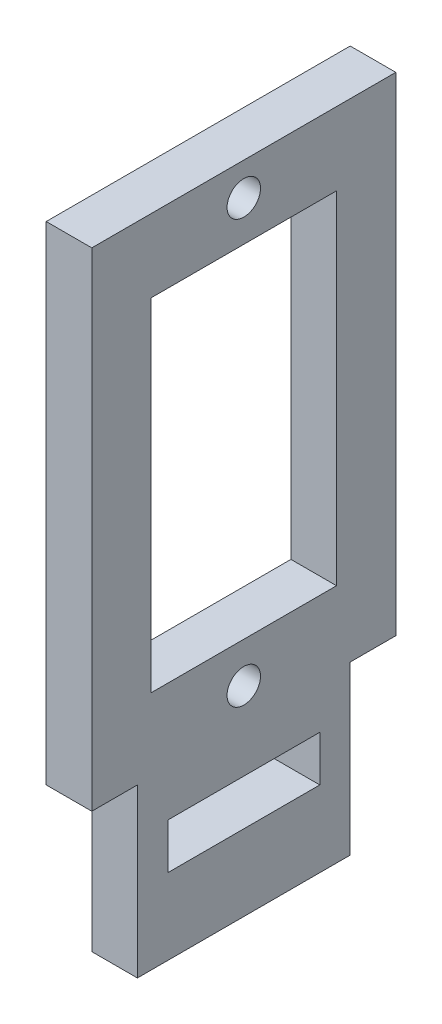
ISO-10303-21;
HEADER;
FILE_DESCRIPTION(('STEP AP214'),'2;1');
FILE_NAME('part.step','',(''),(''),'','','');
FILE_SCHEMA(('AUTOMOTIVE_DESIGN { 1 0 10303 214 1 1 1 1 }'));
ENDSEC;
DATA;
#1=APPLICATION_CONTEXT('core data for automotive mechanical design processes');
#2=APPLICATION_PROTOCOL_DEFINITION('international standard','automotive_design',2000,#1);
#3=PRODUCT_CONTEXT('',#1,'mechanical');
#4=PRODUCT('Part','Part','',(#3));
#5=PRODUCT_RELATED_PRODUCT_CATEGORY('part','',(#4));
#6=PRODUCT_DEFINITION_FORMATION('','',#4);
#7=PRODUCT_DEFINITION_CONTEXT('part definition',#1,'design');
#8=PRODUCT_DEFINITION('design','',#6,#7);
#9=PRODUCT_DEFINITION_SHAPE('','',#8);
#10=(LENGTH_UNIT() NAMED_UNIT(*) SI_UNIT(.MILLI.,.METRE.));
#11=(NAMED_UNIT(*) PLANE_ANGLE_UNIT() SI_UNIT($,.RADIAN.));
#12=(NAMED_UNIT(*) SI_UNIT($,.STERADIAN.) SOLID_ANGLE_UNIT());
#13=UNCERTAINTY_MEASURE_WITH_UNIT(LENGTH_MEASURE(1.E-05),#10,'distance_accuracy_value','');
#14=(GEOMETRIC_REPRESENTATION_CONTEXT(3) GLOBAL_UNCERTAINTY_ASSIGNED_CONTEXT((#13)) GLOBAL_UNIT_ASSIGNED_CONTEXT((#10,
#11,#12)) REPRESENTATION_CONTEXT('',''));
#15=CARTESIAN_POINT('',(0.,0.,0.));
#16=DIRECTION('',(0.,0.,1.));
#17=DIRECTION('',(1.,0.,0.));
#18=AXIS2_PLACEMENT_3D('',#15,#16,#17);
#19=CARTESIAN_POINT('',(3.,0.,0.));
#20=DIRECTION('',(-1.,0.,0.));
#21=DIRECTION('',(0.,0.,1.));
#22=AXIS2_PLACEMENT_3D('',#19,#20,#21);
#23=PLANE('',#22);
#24=CARTESIAN_POINT('',(3.,13.15,-10.));
#25=DIRECTION('',(-1.,0.,0.));
#26=DIRECTION('',(0.,0.,1.));
#27=AXIS2_PLACEMENT_3D('',#24,#25,#26);
#28=CIRCLE('',#27,1.1);
#29=CARTESIAN_POINT('',(3.,13.15,-8.9));
#30=VERTEX_POINT('',#29);
#31=EDGE_CURVE('E229',#30,#30,#28,.T.);
#32=ORIENTED_EDGE('',*,*,#31,.T.);
#33=EDGE_LOOP('',(#32));
#34=FACE_BOUND('',#33,.T.);
#35=DIRECTION('',(0.,0.,1.));
#36=VECTOR('',#35,1.);
#37=CARTESIAN_POINT('',(3.,15.8,-16.1));
#38=LINE('',#37,#36);
#39=CARTESIAN_POINT('',(3.,15.8,-16.1));
#40=VERTEX_POINT('',#39);
#41=CARTESIAN_POINT('',(3.,15.8,-3.9));
#42=VERTEX_POINT('',#41);
#43=EDGE_CURVE('E156',#40,#42,#38,.T.);
#44=ORIENTED_EDGE('',*,*,#43,.T.);
#45=DIRECTION('',(0.,1.,0.));
#46=VECTOR('',#45,1.);
#47=CARTESIAN_POINT('',(3.,15.8,-3.9));
#48=LINE('',#47,#46);
#49=CARTESIAN_POINT('',(3.,38.3,-3.9));
#50=VERTEX_POINT('',#49);
#51=EDGE_CURVE('E150',#42,#50,#48,.T.);
#52=ORIENTED_EDGE('',*,*,#51,.T.);
#53=DIRECTION('',(0.,0.,-1.));
#54=VECTOR('',#53,1.);
#55=CARTESIAN_POINT('',(3.,38.3,-16.1));
#56=LINE('',#55,#54);
#57=CARTESIAN_POINT('',(3.,38.3,-16.1));
#58=VERTEX_POINT('',#57);
#59=EDGE_CURVE('E159',#50,#58,#56,.T.);
#60=ORIENTED_EDGE('',*,*,#59,.T.);
#61=DIRECTION('',(0.,-1.,0.));
#62=VECTOR('',#61,1.);
#63=CARTESIAN_POINT('',(3.,15.8,-16.1));
#64=LINE('',#63,#62);
#65=EDGE_CURVE('E50',#58,#40,#64,.T.);
#66=ORIENTED_EDGE('',*,*,#65,.T.);
#67=EDGE_LOOP('',(#44,#52,#60,#66));
#68=FACE_BOUND('',#67,.T.);
#69=CARTESIAN_POINT('',(3.,40.95,-10.));
#70=DIRECTION('',(-1.,0.,0.));
#71=DIRECTION('',(0.,0.,1.));
#72=AXIS2_PLACEMENT_3D('',#69,#70,#71);
#73=CIRCLE('',#72,1.1);
#74=CARTESIAN_POINT('',(3.,40.95,-8.90000000000001));
#75=VERTEX_POINT('',#74);
#76=EDGE_CURVE('E222',#75,#75,#73,.T.);
#77=ORIENTED_EDGE('',*,*,#76,.T.);
#78=EDGE_LOOP('',(#77));
#79=FACE_BOUND('',#78,.T.);
#80=DIRECTION('',(0.,1.,0.));
#81=VECTOR('',#80,1.);
#82=CARTESIAN_POINT('',(3.,0.,-17.));
#83=LINE('',#82,#81);
#84=CARTESIAN_POINT('',(3.,0.,-17.));
#85=VERTEX_POINT('',#84);
#86=CARTESIAN_POINT('',(3.,11.,-17.));
#87=VERTEX_POINT('',#86);
#88=EDGE_CURVE('E187',#85,#87,#83,.T.);
#89=ORIENTED_EDGE('',*,*,#88,.T.);
#90=DIRECTION('',(0.,0.,-1.));
#91=VECTOR('',#90,1.);
#92=CARTESIAN_POINT('',(3.,11.,-20.));
#93=LINE('',#92,#91);
#94=CARTESIAN_POINT('',(3.,11.,-20.));
#95=VERTEX_POINT('',#94);
#96=EDGE_CURVE('E190',#87,#95,#93,.T.);
#97=ORIENTED_EDGE('',*,*,#96,.T.);
#98=DIRECTION('',(0.,1.,0.));
#99=VECTOR('',#98,1.);
#100=CARTESIAN_POINT('',(3.,0.,-20.));
#101=LINE('',#100,#99);
#102=CARTESIAN_POINT('',(3.,43.1,-20.));
#103=VERTEX_POINT('',#102);
#104=EDGE_CURVE('E268',#95,#103,#101,.T.);
#105=ORIENTED_EDGE('',*,*,#104,.T.);
#106=DIRECTION('',(0.,0.,1.));
#107=VECTOR('',#106,1.);
#108=CARTESIAN_POINT('',(3.,43.1,0.));
#109=LINE('',#108,#107);
#110=CARTESIAN_POINT('',(3.,43.1,0.));
#111=VERTEX_POINT('',#110);
#112=EDGE_CURVE('E270',#103,#111,#109,.T.);
#113=ORIENTED_EDGE('',*,*,#112,.T.);
#114=DIRECTION('',(0.,-1.,0.));
#115=VECTOR('',#114,1.);
#116=CARTESIAN_POINT('',(3.,0.,0.));
#117=LINE('',#116,#115);
#118=CARTESIAN_POINT('',(3.,11.,0.));
#119=VERTEX_POINT('',#118);
#120=EDGE_CURVE('E261',#111,#119,#117,.T.);
#121=ORIENTED_EDGE('',*,*,#120,.T.);
#122=DIRECTION('',(0.,0.,-1.));
#123=VECTOR('',#122,1.);
#124=CARTESIAN_POINT('',(3.,11.,0.));
#125=LINE('',#124,#123);
#126=CARTESIAN_POINT('',(3.,11.,-3.));
#127=VERTEX_POINT('',#126);
#128=EDGE_CURVE('E205',#119,#127,#125,.T.);
#129=ORIENTED_EDGE('',*,*,#128,.T.);
#130=DIRECTION('',(0.,-1.,0.));
#131=VECTOR('',#130,1.);
#132=CARTESIAN_POINT('',(3.,0.,-3.));
#133=LINE('',#132,#131);
#134=CARTESIAN_POINT('',(3.,0.,-3.));
#135=VERTEX_POINT('',#134);
#136=EDGE_CURVE('E208',#127,#135,#133,.T.);
#137=ORIENTED_EDGE('',*,*,#136,.T.);
#138=DIRECTION('',(0.,0.,-1.));
#139=VECTOR('',#138,1.);
#140=CARTESIAN_POINT('',(3.,0.,0.));
#141=LINE('',#140,#139);
#142=EDGE_CURVE('E264',#135,#85,#141,.T.);
#143=ORIENTED_EDGE('',*,*,#142,.T.);
#144=EDGE_LOOP('',(#89,#97,#105,#113,#121,#129,#137,#143));
#145=FACE_BOUND('',#144,.T.);
#146=DIRECTION('',(0.,-1.,0.));
#147=VECTOR('',#146,1.);
#148=CARTESIAN_POINT('',(3.,5.,-5.));
#149=LINE('',#148,#147);
#150=CARTESIAN_POINT('',(3.,8.,-5.));
#151=VERTEX_POINT('',#150);
#152=CARTESIAN_POINT('',(3.,5.,-5.));
#153=VERTEX_POINT('',#152);
#154=EDGE_CURVE('E230',#151,#153,#149,.T.);
#155=ORIENTED_EDGE('',*,*,#154,.F.);
#156=DIRECTION('',(0.,0.,1.));
#157=VECTOR('',#156,1.);
#158=CARTESIAN_POINT('',(3.,8.,-5.));
#159=LINE('',#158,#157);
#160=CARTESIAN_POINT('',(3.,8.,-15.));
#161=VERTEX_POINT('',#160);
#162=EDGE_CURVE('E238',#161,#151,#159,.T.);
#163=ORIENTED_EDGE('',*,*,#162,.F.);
#164=DIRECTION('',(0.,1.,0.));
#165=VECTOR('',#164,1.);
#166=CARTESIAN_POINT('',(3.,5.,-15.));
#167=LINE('',#166,#165);
#168=CARTESIAN_POINT('',(3.,5.,-15.));
#169=VERTEX_POINT('',#168);
#170=EDGE_CURVE('E235',#169,#161,#167,.T.);
#171=ORIENTED_EDGE('',*,*,#170,.F.);
#172=DIRECTION('',(0.,0.,-1.));
#173=VECTOR('',#172,1.);
#174=CARTESIAN_POINT('',(3.,5.,-5.));
#175=LINE('',#174,#173);
#176=EDGE_CURVE('E232',#153,#169,#175,.T.);
#177=ORIENTED_EDGE('',*,*,#176,.F.);
#178=EDGE_LOOP('',(#155,#163,#171,#177));
#179=FACE_BOUND('',#178,.T.);
#180=ADVANCED_FACE('F35',(#34,#68,#79,#145,#179),#23,.F.);
#181=CARTESIAN_POINT('',(0.,0.,0.));
#182=DIRECTION('',(-1.,0.,0.));
#183=DIRECTION('',(0.,0.,1.));
#184=AXIS2_PLACEMENT_3D('',#181,#182,#183);
#185=PLANE('',#184);
#186=CARTESIAN_POINT('',(0.,13.15,-10.));
#187=DIRECTION('',(-1.,0.,0.));
#188=DIRECTION('',(0.,0.,1.));
#189=AXIS2_PLACEMENT_3D('',#186,#187,#188);
#190=CIRCLE('',#189,1.1);
#191=CARTESIAN_POINT('',(0.,13.15,-8.9));
#192=VERTEX_POINT('',#191);
#193=EDGE_CURVE('E171',#192,#192,#190,.T.);
#194=ORIENTED_EDGE('',*,*,#193,.F.);
#195=EDGE_LOOP('',(#194));
#196=FACE_BOUND('',#195,.T.);
#197=DIRECTION('',(0.,1.,0.));
#198=VECTOR('',#197,1.);
#199=CARTESIAN_POINT('',(0.,15.8,-3.9));
#200=LINE('',#199,#198);
#201=CARTESIAN_POINT('',(0.,15.8,-3.9));
#202=VERTEX_POINT('',#201);
#203=CARTESIAN_POINT('',(0.,38.3,-3.9));
#204=VERTEX_POINT('',#203);
#205=EDGE_CURVE('E58',#202,#204,#200,.T.);
#206=ORIENTED_EDGE('',*,*,#205,.F.);
#207=DIRECTION('',(0.,0.,1.));
#208=VECTOR('',#207,1.);
#209=CARTESIAN_POINT('',(0.,15.8,-16.1));
#210=LINE('',#209,#208);
#211=CARTESIAN_POINT('',(0.,15.8,-16.1));
#212=VERTEX_POINT('',#211);
#213=EDGE_CURVE('E165',#212,#202,#210,.T.);
#214=ORIENTED_EDGE('',*,*,#213,.F.);
#215=DIRECTION('',(0.,-1.,0.));
#216=VECTOR('',#215,1.);
#217=CARTESIAN_POINT('',(0.,15.8,-16.1));
#218=LINE('',#217,#216);
#219=CARTESIAN_POINT('',(0.,38.3,-16.1));
#220=VERTEX_POINT('',#219);
#221=EDGE_CURVE('E168',#220,#212,#218,.T.);
#222=ORIENTED_EDGE('',*,*,#221,.F.);
#223=DIRECTION('',(0.,0.,-1.));
#224=VECTOR('',#223,1.);
#225=CARTESIAN_POINT('',(0.,38.3,-16.1));
#226=LINE('',#225,#224);
#227=EDGE_CURVE('E177',#204,#220,#226,.T.);
#228=ORIENTED_EDGE('',*,*,#227,.F.);
#229=EDGE_LOOP('',(#206,#214,#222,#228));
#230=FACE_BOUND('',#229,.T.);
#231=DIRECTION('',(0.,0.,-1.));
#232=VECTOR('',#231,1.);
#233=CARTESIAN_POINT('',(0.,11.,-20.));
#234=LINE('',#233,#232);
#235=CARTESIAN_POINT('',(0.,11.,-17.));
#236=VERTEX_POINT('',#235);
#237=CARTESIAN_POINT('',(0.,11.,-20.));
#238=VERTEX_POINT('',#237);
#239=EDGE_CURVE('E191',#236,#238,#234,.T.);
#240=ORIENTED_EDGE('',*,*,#239,.F.);
#241=DIRECTION('',(0.,1.,0.));
#242=VECTOR('',#241,1.);
#243=CARTESIAN_POINT('',(0.,0.,-17.));
#244=LINE('',#243,#242);
#245=CARTESIAN_POINT('',(0.,0.,-17.));
#246=VERTEX_POINT('',#245);
#247=EDGE_CURVE('E195',#246,#236,#244,.T.);
#248=ORIENTED_EDGE('',*,*,#247,.F.);
#249=DIRECTION('',(0.,0.,-1.));
#250=VECTOR('',#249,1.);
#251=CARTESIAN_POINT('',(0.,0.,0.));
#252=LINE('',#251,#250);
#253=CARTESIAN_POINT('',(0.,0.,-3.));
#254=VERTEX_POINT('',#253);
#255=EDGE_CURVE('E274',#254,#246,#252,.T.);
#256=ORIENTED_EDGE('',*,*,#255,.F.);
#257=DIRECTION('',(0.,-1.,0.));
#258=VECTOR('',#257,1.);
#259=CARTESIAN_POINT('',(0.,0.,-3.));
#260=LINE('',#259,#258);
#261=CARTESIAN_POINT('',(0.,11.,-3.));
#262=VERTEX_POINT('',#261);
#263=EDGE_CURVE('E209',#262,#254,#260,.T.);
#264=ORIENTED_EDGE('',*,*,#263,.F.);
#265=DIRECTION('',(0.,0.,-1.));
#266=VECTOR('',#265,1.);
#267=CARTESIAN_POINT('',(0.,11.,0.));
#268=LINE('',#267,#266);
#269=CARTESIAN_POINT('',(0.,11.,0.));
#270=VERTEX_POINT('',#269);
#271=EDGE_CURVE('E213',#270,#262,#268,.T.);
#272=ORIENTED_EDGE('',*,*,#271,.F.);
#273=DIRECTION('',(0.,-1.,0.));
#274=VECTOR('',#273,1.);
#275=CARTESIAN_POINT('',(0.,0.,0.));
#276=LINE('',#275,#274);
#277=CARTESIAN_POINT('',(0.,43.1,0.));
#278=VERTEX_POINT('',#277);
#279=EDGE_CURVE('E260',#278,#270,#276,.T.);
#280=ORIENTED_EDGE('',*,*,#279,.F.);
#281=DIRECTION('',(0.,0.,1.));
#282=VECTOR('',#281,1.);
#283=CARTESIAN_POINT('',(0.,43.1,0.));
#284=LINE('',#283,#282);
#285=CARTESIAN_POINT('',(0.,43.1,-20.));
#286=VERTEX_POINT('',#285);
#287=EDGE_CURVE('E265',#286,#278,#284,.T.);
#288=ORIENTED_EDGE('',*,*,#287,.F.);
#289=DIRECTION('',(0.,1.,0.));
#290=VECTOR('',#289,1.);
#291=CARTESIAN_POINT('',(0.,0.,-20.));
#292=LINE('',#291,#290);
#293=EDGE_CURVE('E277',#238,#286,#292,.T.);
#294=ORIENTED_EDGE('',*,*,#293,.F.);
#295=EDGE_LOOP('',(#240,#248,#256,#264,#272,#280,#288,#294));
#296=FACE_BOUND('',#295,.T.);
#297=CARTESIAN_POINT('',(0.,40.95,-10.));
#298=DIRECTION('',(-1.,0.,0.));
#299=DIRECTION('',(0.,0.,1.));
#300=AXIS2_PLACEMENT_3D('',#297,#298,#299);
#301=CIRCLE('',#300,1.1);
#302=CARTESIAN_POINT('',(0.,40.95,-8.90000000000001));
#303=VERTEX_POINT('',#302);
#304=EDGE_CURVE('E226',#303,#303,#301,.T.);
#305=ORIENTED_EDGE('',*,*,#304,.F.);
#306=EDGE_LOOP('',(#305));
#307=FACE_BOUND('',#306,.T.);
#308=DIRECTION('',(0.,0.,1.));
#309=VECTOR('',#308,1.);
#310=CARTESIAN_POINT('',(0.,8.,-5.));
#311=LINE('',#310,#309);
#312=CARTESIAN_POINT('',(0.,8.,-15.));
#313=VERTEX_POINT('',#312);
#314=CARTESIAN_POINT('',(0.,8.,-5.));
#315=VERTEX_POINT('',#314);
#316=EDGE_CURVE('E233',#313,#315,#311,.T.);
#317=ORIENTED_EDGE('',*,*,#316,.T.);
#318=DIRECTION('',(0.,-1.,0.));
#319=VECTOR('',#318,1.);
#320=CARTESIAN_POINT('',(0.,5.,-5.));
#321=LINE('',#320,#319);
#322=CARTESIAN_POINT('',(0.,5.,-5.));
#323=VERTEX_POINT('',#322);
#324=EDGE_CURVE('E225',#315,#323,#321,.T.);
#325=ORIENTED_EDGE('',*,*,#324,.T.);
#326=DIRECTION('',(0.,0.,-1.));
#327=VECTOR('',#326,1.);
#328=CARTESIAN_POINT('',(0.,5.,-5.));
#329=LINE('',#328,#327);
#330=CARTESIAN_POINT('',(0.,5.,-15.));
#331=VERTEX_POINT('',#330);
#332=EDGE_CURVE('E243',#323,#331,#329,.T.);
#333=ORIENTED_EDGE('',*,*,#332,.T.);
#334=DIRECTION('',(0.,1.,0.));
#335=VECTOR('',#334,1.);
#336=CARTESIAN_POINT('',(0.,5.,-15.));
#337=LINE('',#336,#335);
#338=EDGE_CURVE('E246',#331,#313,#337,.T.);
#339=ORIENTED_EDGE('',*,*,#338,.T.);
#340=EDGE_LOOP('',(#317,#325,#333,#339));
#341=FACE_BOUND('',#340,.T.);
#342=ADVANCED_FACE('F291',(#196,#230,#296,#307,#341),#185,.T.);
#343=CARTESIAN_POINT('',(3.,0.,0.));
#344=DIRECTION('',(0.,0.,-1.));
#345=DIRECTION('',(-1.,0.,0.));
#346=AXIS2_PLACEMENT_3D('',#343,#344,#345);
#347=PLANE('',#346);
#348=ORIENTED_EDGE('',*,*,#279,.T.);
#349=DIRECTION('',(-1.,0.,0.));
#350=VECTOR('',#349,1.);
#351=CARTESIAN_POINT('',(3.,11.,0.));
#352=LINE('',#351,#350);
#353=EDGE_CURVE('E212',#119,#270,#352,.T.);
#354=ORIENTED_EDGE('',*,*,#353,.F.);
#355=ORIENTED_EDGE('',*,*,#120,.F.);
#356=DIRECTION('',(-1.,0.,0.));
#357=VECTOR('',#356,1.);
#358=CARTESIAN_POINT('',(3.,43.1,0.));
#359=LINE('',#358,#357);
#360=EDGE_CURVE('E43',#111,#278,#359,.T.);
#361=ORIENTED_EDGE('',*,*,#360,.T.);
#362=EDGE_LOOP('',(#348,#354,#355,#361));
#363=FACE_BOUND('',#362,.T.);
#364=ADVANCED_FACE('F37',(#363),#347,.F.);
#365=CARTESIAN_POINT('',(3.,0.,0.));
#366=DIRECTION('',(0.,1.,0.));
#367=DIRECTION('',(0.,0.,1.));
#368=AXIS2_PLACEMENT_3D('',#365,#366,#367);
#369=PLANE('',#368);
#370=ORIENTED_EDGE('',*,*,#255,.T.);
#371=DIRECTION('',(-1.,0.,0.));
#372=VECTOR('',#371,1.);
#373=CARTESIAN_POINT('',(3.,0.,-17.));
#374=LINE('',#373,#372);
#375=EDGE_CURVE('E194',#85,#246,#374,.T.);
#376=ORIENTED_EDGE('',*,*,#375,.F.);
#377=ORIENTED_EDGE('',*,*,#142,.F.);
#378=DIRECTION('',(-1.,0.,0.));
#379=VECTOR('',#378,1.);
#380=CARTESIAN_POINT('',(3.,0.,-3.));
#381=LINE('',#380,#379);
#382=EDGE_CURVE('E198',#135,#254,#381,.T.);
#383=ORIENTED_EDGE('',*,*,#382,.T.);
#384=EDGE_LOOP('',(#370,#376,#377,#383));
#385=FACE_BOUND('',#384,.T.);
#386=ADVANCED_FACE('F315',(#385),#369,.F.);
#387=CARTESIAN_POINT('',(3.,0.,-20.));
#388=DIRECTION('',(0.,0.,1.));
#389=DIRECTION('',(0.,-1.,0.));
#390=AXIS2_PLACEMENT_3D('',#387,#388,#389);
#391=PLANE('',#390);
#392=ORIENTED_EDGE('',*,*,#104,.F.);
#393=DIRECTION('',(-1.,0.,0.));
#394=VECTOR('',#393,1.);
#395=CARTESIAN_POINT('',(3.,11.,-20.));
#396=LINE('',#395,#394);
#397=EDGE_CURVE('E178',#95,#238,#396,.T.);
#398=ORIENTED_EDGE('',*,*,#397,.T.);
#399=ORIENTED_EDGE('',*,*,#293,.T.);
#400=DIRECTION('',(-1.,0.,0.));
#401=VECTOR('',#400,1.);
#402=CARTESIAN_POINT('',(3.,43.1,-20.));
#403=LINE('',#402,#401);
#404=EDGE_CURVE('E11',#103,#286,#403,.T.);
#405=ORIENTED_EDGE('',*,*,#404,.F.);
#406=EDGE_LOOP('',(#392,#398,#399,#405));
#407=FACE_BOUND('',#406,.T.);
#408=ADVANCED_FACE('F305',(#407),#391,.F.);
#409=CARTESIAN_POINT('',(3.,43.1,0.));
#410=DIRECTION('',(0.,-1.,0.));
#411=DIRECTION('',(0.,0.,-1.));
#412=AXIS2_PLACEMENT_3D('',#409,#410,#411);
#413=PLANE('',#412);
#414=ORIENTED_EDGE('',*,*,#287,.T.);
#415=ORIENTED_EDGE('',*,*,#360,.F.);
#416=ORIENTED_EDGE('',*,*,#112,.F.);
#417=ORIENTED_EDGE('',*,*,#404,.T.);
#418=EDGE_LOOP('',(#414,#415,#416,#417));
#419=FACE_BOUND('',#418,.T.);
#420=ADVANCED_FACE('F303',(#419),#413,.F.);
#421=CARTESIAN_POINT('',(3.,5.,-5.));
#422=DIRECTION('',(0.,0.,-1.));
#423=DIRECTION('',(-1.,0.,0.));
#424=AXIS2_PLACEMENT_3D('',#421,#422,#423);
#425=PLANE('',#424);
#426=ORIENTED_EDGE('',*,*,#324,.F.);
#427=DIRECTION('',(-1.,0.,0.));
#428=VECTOR('',#427,1.);
#429=CARTESIAN_POINT('',(3.,8.,-5.));
#430=LINE('',#429,#428);
#431=EDGE_CURVE('E240',#151,#315,#430,.T.);
#432=ORIENTED_EDGE('',*,*,#431,.F.);
#433=ORIENTED_EDGE('',*,*,#154,.T.);
#434=DIRECTION('',(-1.,0.,0.));
#435=VECTOR('',#434,1.);
#436=CARTESIAN_POINT('',(3.,5.,-5.));
#437=LINE('',#436,#435);
#438=EDGE_CURVE('E257',#153,#323,#437,.T.);
#439=ORIENTED_EDGE('',*,*,#438,.T.);
#440=EDGE_LOOP('',(#426,#432,#433,#439));
#441=FACE_BOUND('',#440,.T.);
#442=ADVANCED_FACE('F336',(#441),#425,.T.);
#443=CARTESIAN_POINT('',(3.,5.,-5.));
#444=DIRECTION('',(0.,1.,0.));
#445=DIRECTION('',(0.,0.,1.));
#446=AXIS2_PLACEMENT_3D('',#443,#444,#445);
#447=PLANE('',#446);
#448=ORIENTED_EDGE('',*,*,#332,.F.);
#449=ORIENTED_EDGE('',*,*,#438,.F.);
#450=ORIENTED_EDGE('',*,*,#176,.T.);
#451=DIRECTION('',(-1.,0.,0.));
#452=VECTOR('',#451,1.);
#453=CARTESIAN_POINT('',(3.,5.,-15.));
#454=LINE('',#453,#452);
#455=EDGE_CURVE('E255',#169,#331,#454,.T.);
#456=ORIENTED_EDGE('',*,*,#455,.T.);
#457=EDGE_LOOP('',(#448,#449,#450,#456));
#458=FACE_BOUND('',#457,.T.);
#459=ADVANCED_FACE('F379',(#458),#447,.T.);
#460=CARTESIAN_POINT('',(3.,5.,-15.));
#461=DIRECTION('',(0.,0.,1.));
#462=DIRECTION('',(1.,0.,0.));
#463=AXIS2_PLACEMENT_3D('',#460,#461,#462);
#464=PLANE('',#463);
#465=ORIENTED_EDGE('',*,*,#338,.F.);
#466=ORIENTED_EDGE('',*,*,#455,.F.);
#467=ORIENTED_EDGE('',*,*,#170,.T.);
#468=DIRECTION('',(-1.,0.,0.));
#469=VECTOR('',#468,1.);
#470=CARTESIAN_POINT('',(3.,8.,-15.));
#471=LINE('',#470,#469);
#472=EDGE_CURVE('E253',#161,#313,#471,.T.);
#473=ORIENTED_EDGE('',*,*,#472,.T.);
#474=EDGE_LOOP('',(#465,#466,#467,#473));
#475=FACE_BOUND('',#474,.T.);
#476=ADVANCED_FACE('F367',(#475),#464,.T.);
#477=CARTESIAN_POINT('',(3.,8.,-5.));
#478=DIRECTION('',(0.,-1.,0.));
#479=DIRECTION('',(0.,0.,-1.));
#480=AXIS2_PLACEMENT_3D('',#477,#478,#479);
#481=PLANE('',#480);
#482=ORIENTED_EDGE('',*,*,#316,.F.);
#483=ORIENTED_EDGE('',*,*,#472,.F.);
#484=ORIENTED_EDGE('',*,*,#162,.T.);
#485=ORIENTED_EDGE('',*,*,#431,.T.);
#486=EDGE_LOOP('',(#482,#483,#484,#485));
#487=FACE_BOUND('',#486,.T.);
#488=ADVANCED_FACE('F361',(#487),#481,.T.);
#489=CARTESIAN_POINT('',(3.,40.95,-10.));
#490=DIRECTION('',(-1.,0.,0.));
#491=DIRECTION('',(0.,0.,1.));
#492=AXIS2_PLACEMENT_3D('',#489,#490,#491);
#493=CYLINDRICAL_SURFACE('',#492,1.1);
#494=ORIENTED_EDGE('',*,*,#76,.F.);
#495=EDGE_LOOP('',(#494));
#496=FACE_BOUND('',#495,.T.);
#497=ORIENTED_EDGE('',*,*,#304,.T.);
#498=EDGE_LOOP('',(#497));
#499=FACE_BOUND('',#498,.T.);
#500=ADVANCED_FACE('F366',(#496,#499),#493,.F.);
#501=CARTESIAN_POINT('',(3.,11.,-20.));
#502=DIRECTION('',(0.,1.,0.));
#503=DIRECTION('',(0.,0.,1.));
#504=AXIS2_PLACEMENT_3D('',#501,#502,#503);
#505=PLANE('',#504);
#506=ORIENTED_EDGE('',*,*,#239,.T.);
#507=ORIENTED_EDGE('',*,*,#397,.F.);
#508=ORIENTED_EDGE('',*,*,#96,.F.);
#509=DIRECTION('',(-1.,0.,0.));
#510=VECTOR('',#509,1.);
#511=CARTESIAN_POINT('',(3.,11.,-17.));
#512=LINE('',#511,#510);
#513=EDGE_CURVE('E202',#87,#236,#512,.T.);
#514=ORIENTED_EDGE('',*,*,#513,.T.);
#515=EDGE_LOOP('',(#506,#507,#508,#514));
#516=FACE_BOUND('',#515,.T.);
#517=ADVANCED_FACE('F308',(#516),#505,.F.);
#518=CARTESIAN_POINT('',(3.,0.,-17.));
#519=DIRECTION('',(0.,0.,1.));
#520=DIRECTION('',(1.,0.,0.));
#521=AXIS2_PLACEMENT_3D('',#518,#519,#520);
#522=PLANE('',#521);
#523=ORIENTED_EDGE('',*,*,#247,.T.);
#524=ORIENTED_EDGE('',*,*,#513,.F.);
#525=ORIENTED_EDGE('',*,*,#88,.F.);
#526=ORIENTED_EDGE('',*,*,#375,.T.);
#527=EDGE_LOOP('',(#523,#524,#525,#526));
#528=FACE_BOUND('',#527,.T.);
#529=ADVANCED_FACE('F311',(#528),#522,.F.);
#530=CARTESIAN_POINT('',(3.,0.,-3.));
#531=DIRECTION('',(0.,0.,-1.));
#532=DIRECTION('',(-1.,0.,0.));
#533=AXIS2_PLACEMENT_3D('',#530,#531,#532);
#534=PLANE('',#533);
#535=ORIENTED_EDGE('',*,*,#263,.T.);
#536=ORIENTED_EDGE('',*,*,#382,.F.);
#537=ORIENTED_EDGE('',*,*,#136,.F.);
#538=DIRECTION('',(-1.,0.,0.));
#539=VECTOR('',#538,1.);
#540=CARTESIAN_POINT('',(3.,11.,-3.));
#541=LINE('',#540,#539);
#542=EDGE_CURVE('E219',#127,#262,#541,.T.);
#543=ORIENTED_EDGE('',*,*,#542,.T.);
#544=EDGE_LOOP('',(#535,#536,#537,#543));
#545=FACE_BOUND('',#544,.T.);
#546=ADVANCED_FACE('F317',(#545),#534,.F.);
#547=CARTESIAN_POINT('',(3.,11.,0.));
#548=DIRECTION('',(0.,1.,0.));
#549=DIRECTION('',(0.,0.,1.));
#550=AXIS2_PLACEMENT_3D('',#547,#548,#549);
#551=PLANE('',#550);
#552=ORIENTED_EDGE('',*,*,#271,.T.);
#553=ORIENTED_EDGE('',*,*,#542,.F.);
#554=ORIENTED_EDGE('',*,*,#128,.F.);
#555=ORIENTED_EDGE('',*,*,#353,.T.);
#556=EDGE_LOOP('',(#552,#553,#554,#555));
#557=FACE_BOUND('',#556,.T.);
#558=ADVANCED_FACE('F297',(#557),#551,.F.);
#559=CARTESIAN_POINT('',(3.,15.8,-3.9));
#560=DIRECTION('',(0.,0.,1.));
#561=DIRECTION('',(1.,0.,0.));
#562=AXIS2_PLACEMENT_3D('',#559,#560,#561);
#563=PLANE('',#562);
#564=ORIENTED_EDGE('',*,*,#205,.T.);
#565=DIRECTION('',(-1.,0.,0.));
#566=VECTOR('',#565,1.);
#567=CARTESIAN_POINT('',(3.,38.3,-3.9));
#568=LINE('',#567,#566);
#569=EDGE_CURVE('E146',#50,#204,#568,.T.);
#570=ORIENTED_EDGE('',*,*,#569,.F.);
#571=ORIENTED_EDGE('',*,*,#51,.F.);
#572=DIRECTION('',(-1.,0.,0.));
#573=VECTOR('',#572,1.);
#574=CARTESIAN_POINT('',(3.,15.8,-3.9));
#575=LINE('',#574,#573);
#576=EDGE_CURVE('E182',#42,#202,#575,.T.);
#577=ORIENTED_EDGE('',*,*,#576,.T.);
#578=EDGE_LOOP('',(#564,#570,#571,#577));
#579=FACE_BOUND('',#578,.T.);
#580=ADVANCED_FACE('F148',(#579),#563,.F.);
#581=CARTESIAN_POINT('',(3.,15.8,-16.1));
#582=DIRECTION('',(0.,-1.,0.));
#583=DIRECTION('',(0.,0.,-1.));
#584=AXIS2_PLACEMENT_3D('',#581,#582,#583);
#585=PLANE('',#584);
#586=ORIENTED_EDGE('',*,*,#213,.T.);
#587=ORIENTED_EDGE('',*,*,#576,.F.);
#588=ORIENTED_EDGE('',*,*,#43,.F.);
#589=DIRECTION('',(-1.,0.,0.));
#590=VECTOR('',#589,1.);
#591=CARTESIAN_POINT('',(3.,15.8,-16.1));
#592=LINE('',#591,#590);
#593=EDGE_CURVE('E184',#40,#212,#592,.T.);
#594=ORIENTED_EDGE('',*,*,#593,.T.);
#595=EDGE_LOOP('',(#586,#587,#588,#594));
#596=FACE_BOUND('',#595,.T.);
#597=ADVANCED_FACE('F450',(#596),#585,.F.);
#598=CARTESIAN_POINT('',(3.,15.8,-16.1));
#599=DIRECTION('',(0.,0.,-1.));
#600=DIRECTION('',(-1.,0.,0.));
#601=AXIS2_PLACEMENT_3D('',#598,#599,#600);
#602=PLANE('',#601);
#603=ORIENTED_EDGE('',*,*,#221,.T.);
#604=ORIENTED_EDGE('',*,*,#593,.F.);
#605=ORIENTED_EDGE('',*,*,#65,.F.);
#606=DIRECTION('',(-1.,0.,0.));
#607=VECTOR('',#606,1.);
#608=CARTESIAN_POINT('',(3.,38.3,-16.1));
#609=LINE('',#608,#607);
#610=EDGE_CURVE('E155',#58,#220,#609,.T.);
#611=ORIENTED_EDGE('',*,*,#610,.T.);
#612=EDGE_LOOP('',(#603,#604,#605,#611));
#613=FACE_BOUND('',#612,.T.);
#614=ADVANCED_FACE('F459',(#613),#602,.F.);
#615=CARTESIAN_POINT('',(3.,38.3,-16.1));
#616=DIRECTION('',(0.,1.,0.));
#617=DIRECTION('',(0.,0.,1.));
#618=AXIS2_PLACEMENT_3D('',#615,#616,#617);
#619=PLANE('',#618);
#620=ORIENTED_EDGE('',*,*,#227,.T.);
#621=ORIENTED_EDGE('',*,*,#610,.F.);
#622=ORIENTED_EDGE('',*,*,#59,.F.);
#623=ORIENTED_EDGE('',*,*,#569,.T.);
#624=EDGE_LOOP('',(#620,#621,#622,#623));
#625=FACE_BOUND('',#624,.T.);
#626=ADVANCED_FACE('F160',(#625),#619,.F.);
#627=CARTESIAN_POINT('',(3.,13.15,-10.));
#628=DIRECTION('',(-1.,0.,0.));
#629=DIRECTION('',(0.,0.,1.));
#630=AXIS2_PLACEMENT_3D('',#627,#628,#629);
#631=CYLINDRICAL_SURFACE('',#630,1.1);
#632=ORIENTED_EDGE('',*,*,#31,.F.);
#633=EDGE_LOOP('',(#632));
#634=FACE_BOUND('',#633,.T.);
#635=ORIENTED_EDGE('',*,*,#193,.T.);
#636=EDGE_LOOP('',(#635));
#637=FACE_BOUND('',#636,.T.);
#638=ADVANCED_FACE('F477',(#634,#637),#631,.F.);
#639=CLOSED_SHELL('',(#180,#342,#364,#386,#408,#420,#442,#459,#476,#488,#500,#517,#529,#546,
#558,#580,#597,#614,#626,#638));
#640=MANIFOLD_SOLID_BREP('B2',#639);
#641=ADVANCED_BREP_SHAPE_REPRESENTATION('',(#18,#640),#14);
#642=SHAPE_DEFINITION_REPRESENTATION(#9,#641);
ENDSEC;
END-ISO-10303-21;
